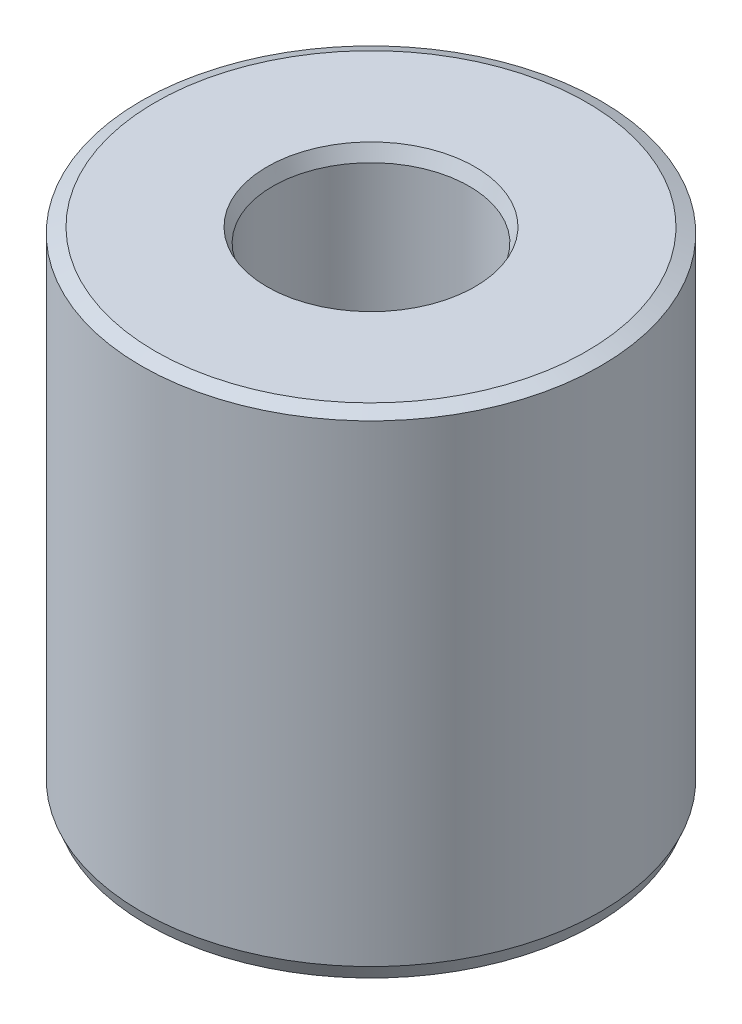
ISO-10303-21;
HEADER;
FILE_DESCRIPTION(('STEP AP214'),'2;1');
FILE_NAME('part.step','',(''),(''),'','','');
FILE_SCHEMA(('AUTOMOTIVE_DESIGN { 1 0 10303 214 1 1 1 1 }'));
ENDSEC;
DATA;
#1=APPLICATION_CONTEXT('core data for automotive mechanical design processes');
#2=APPLICATION_PROTOCOL_DEFINITION('international standard','automotive_design',2000,#1);
#3=PRODUCT_CONTEXT('',#1,'mechanical');
#4=PRODUCT('Part','Part','',(#3));
#5=PRODUCT_RELATED_PRODUCT_CATEGORY('part','',(#4));
#6=PRODUCT_DEFINITION_FORMATION('','',#4);
#7=PRODUCT_DEFINITION_CONTEXT('part definition',#1,'design');
#8=PRODUCT_DEFINITION('design','',#6,#7);
#9=PRODUCT_DEFINITION_SHAPE('','',#8);
#10=(LENGTH_UNIT() NAMED_UNIT(*) SI_UNIT(.MILLI.,.METRE.));
#11=(NAMED_UNIT(*) PLANE_ANGLE_UNIT() SI_UNIT($,.RADIAN.));
#12=(NAMED_UNIT(*) SI_UNIT($,.STERADIAN.) SOLID_ANGLE_UNIT());
#13=UNCERTAINTY_MEASURE_WITH_UNIT(LENGTH_MEASURE(1.E-05),#10,'distance_accuracy_value','');
#14=(GEOMETRIC_REPRESENTATION_CONTEXT(3) GLOBAL_UNCERTAINTY_ASSIGNED_CONTEXT((#13)) GLOBAL_UNIT_ASSIGNED_CONTEXT((#10,
#11,#12)) REPRESENTATION_CONTEXT('',''));
#15=CARTESIAN_POINT('',(0.,0.,0.));
#16=DIRECTION('',(0.,0.,1.));
#17=DIRECTION('',(1.,0.,0.));
#18=AXIS2_PLACEMENT_3D('',#15,#16,#17);
#19=CARTESIAN_POINT('',(0.,37.5116467703798,0.));
#20=DIRECTION('',(0.,-1.,0.));
#21=DIRECTION('',(0.,0.,-1.));
#22=AXIS2_PLACEMENT_3D('',#19,#20,#21);
#23=CYLINDRICAL_SURFACE('',#22,17.5);
#24=CARTESIAN_POINT('',(0.,1.06441298751191,0.));
#25=DIRECTION('',(0.,1.,0.));
#26=DIRECTION('',(0.,0.,1.));
#27=AXIS2_PLACEMENT_3D('',#24,#25,#26);
#28=CIRCLE('',#27,17.5);
#29=CARTESIAN_POINT('',(0.,1.06441298751191,17.5));
#30=VERTEX_POINT('',#29);
#31=EDGE_CURVE('E10',#30,#30,#28,.T.);
#32=ORIENTED_EDGE('',*,*,#31,.T.);
#33=EDGE_LOOP('',(#32));
#34=FACE_BOUND('',#33,.T.);
#35=CARTESIAN_POINT('',(0.,37.0762384011925,0.));
#36=DIRECTION('',(0.,1.,0.));
#37=DIRECTION('',(0.,0.,1.));
#38=AXIS2_PLACEMENT_3D('',#35,#36,#37);
#39=CIRCLE('',#38,17.5);
#40=CARTESIAN_POINT('',(0.,37.0762384011925,17.5));
#41=VERTEX_POINT('',#40);
#42=EDGE_CURVE('E50',#41,#41,#39,.F.);
#43=ORIENTED_EDGE('',*,*,#42,.T.);
#44=EDGE_LOOP('',(#43));
#45=FACE_BOUND('',#44,.T.);
#46=ADVANCED_FACE('F39',(#34,#45),#23,.T.);
#47=CARTESIAN_POINT('',(0.,37.5116467703798,0.));
#48=DIRECTION('',(0.,1.,0.));
#49=DIRECTION('',(0.,0.,1.));
#50=AXIS2_PLACEMENT_3D('',#47,#48,#49);
#51=PLANE('',#50);
#52=CARTESIAN_POINT('',(0.,37.5116467703798,0.));
#53=DIRECTION('',(0.,1.,0.));
#54=DIRECTION('',(0.,0.,1.));
#55=AXIS2_PLACEMENT_3D('',#52,#53,#54);
#56=CIRCLE('',#55,7.92191080034394);
#57=CARTESIAN_POINT('',(0.,37.5116467703798,7.92191080034394));
#58=VERTEX_POINT('',#57);
#59=EDGE_CURVE('E58',#58,#58,#56,.F.);
#60=ORIENTED_EDGE('',*,*,#59,.T.);
#61=EDGE_LOOP('',(#60));
#62=FACE_BOUND('',#61,.T.);
#63=CARTESIAN_POINT('',(0.,37.5116467703798,0.));
#64=DIRECTION('',(0.,1.,0.));
#65=DIRECTION('',(0.,0.,1.));
#66=AXIS2_PLACEMENT_3D('',#63,#64,#65);
#67=CIRCLE('',#66,16.435587012488);
#68=CARTESIAN_POINT('',(0.,37.5116467703798,16.435587012488));
#69=VERTEX_POINT('',#68);
#70=EDGE_CURVE('E61',#69,#69,#67,.T.);
#71=ORIENTED_EDGE('',*,*,#70,.T.);
#72=EDGE_LOOP('',(#71));
#73=FACE_BOUND('',#72,.T.);
#74=ADVANCED_FACE('F88',(#62,#73),#51,.T.);
#75=CARTESIAN_POINT('',(0.,0.,0.));
#76=DIRECTION('',(0.,1.,0.));
#77=DIRECTION('',(0.,0.,1.));
#78=AXIS2_PLACEMENT_3D('',#75,#76,#77);
#79=PLANE('',#78);
#80=CARTESIAN_POINT('',(0.,0.,0.));
#81=DIRECTION('',(0.,1.,0.));
#82=DIRECTION('',(0.,0.,1.));
#83=AXIS2_PLACEMENT_3D('',#80,#81,#82);
#84=CIRCLE('',#83,8.55091541866851);
#85=CARTESIAN_POINT('',(0.,0.,8.55091541866851));
#86=VERTEX_POINT('',#85);
#87=EDGE_CURVE('E51',#86,#86,#84,.T.);
#88=ORIENTED_EDGE('',*,*,#87,.T.);
#89=EDGE_LOOP('',(#88));
#90=FACE_BOUND('',#89,.T.);
#91=CARTESIAN_POINT('',(0.,0.,0.));
#92=DIRECTION('',(0.,1.,0.));
#93=DIRECTION('',(0.,0.,1.));
#94=AXIS2_PLACEMENT_3D('',#91,#92,#93);
#95=CIRCLE('',#94,17.0645916308126);
#96=CARTESIAN_POINT('',(0.,0.,17.0645916308126));
#97=VERTEX_POINT('',#96);
#98=EDGE_CURVE('E54',#97,#97,#95,.F.);
#99=ORIENTED_EDGE('',*,*,#98,.T.);
#100=EDGE_LOOP('',(#99));
#101=FACE_BOUND('',#100,.T.);
#102=ADVANCED_FACE('F83',(#90,#101),#79,.F.);
#103=CARTESIAN_POINT('',(0.,37.5116467703798,0.));
#104=DIRECTION('',(0.,-1.,0.));
#105=DIRECTION('',(0.,0.,-1.));
#106=AXIS2_PLACEMENT_3D('',#103,#104,#105);
#107=CYLINDRICAL_SURFACE('',#106,7.48650243115657);
#108=CARTESIAN_POINT('',(0.,36.4472337828679,0.));
#109=DIRECTION('',(0.,1.,0.));
#110=DIRECTION('',(0.,0.,1.));
#111=AXIS2_PLACEMENT_3D('',#108,#109,#110);
#112=CIRCLE('',#111,7.48650243115657);
#113=CARTESIAN_POINT('',(0.,36.4472337828679,7.48650243115657));
#114=VERTEX_POINT('',#113);
#115=EDGE_CURVE('E67',#114,#114,#112,.T.);
#116=ORIENTED_EDGE('',*,*,#115,.T.);
#117=EDGE_LOOP('',(#116));
#118=FACE_BOUND('',#117,.T.);
#119=CARTESIAN_POINT('',(0.,0.435408369187373,0.));
#120=DIRECTION('',(0.,1.,0.));
#121=DIRECTION('',(0.,0.,1.));
#122=AXIS2_PLACEMENT_3D('',#119,#120,#121);
#123=CIRCLE('',#122,7.48650243115657);
#124=CARTESIAN_POINT('',(0.,0.435408369187373,7.48650243115657));
#125=VERTEX_POINT('',#124);
#126=EDGE_CURVE('E69',#125,#125,#123,.F.);
#127=ORIENTED_EDGE('',*,*,#126,.T.);
#128=EDGE_LOOP('',(#127));
#129=FACE_BOUND('',#128,.T.);
#130=ADVANCED_FACE('F71',(#118,#129),#107,.F.);
#131=CARTESIAN_POINT('',(0.,36.4472337828679,0.));
#132=DIRECTION('',(0.,1.,0.));
#133=DIRECTION('',(0.,0.,1.));
#134=AXIS2_PLACEMENT_3D('',#131,#132,#133);
#135=CONICAL_SURFACE('',#134,7.48650243115657,0.388291912059998);
#136=ORIENTED_EDGE('',*,*,#59,.F.);
#137=EDGE_LOOP('',(#136));
#138=FACE_BOUND('',#137,.T.);
#139=ORIENTED_EDGE('',*,*,#115,.F.);
#140=EDGE_LOOP('',(#139));
#141=FACE_BOUND('',#140,.T.);
#142=ADVANCED_FACE('F77',(#138,#141),#135,.F.);
#143=CARTESIAN_POINT('',(0.,0.,0.));
#144=DIRECTION('',(0.,-1.,0.));
#145=DIRECTION('',(0.,0.,-1.));
#146=AXIS2_PLACEMENT_3D('',#143,#144,#145);
#147=CONICAL_SURFACE('',#146,8.55091541866851,1.1825044147349);
#148=ORIENTED_EDGE('',*,*,#126,.F.);
#149=EDGE_LOOP('',(#148));
#150=FACE_BOUND('',#149,.T.);
#151=ORIENTED_EDGE('',*,*,#87,.F.);
#152=EDGE_LOOP('',(#151));
#153=FACE_BOUND('',#152,.T.);
#154=ADVANCED_FACE('F73',(#150,#153),#147,.F.);
#155=CARTESIAN_POINT('',(0.,1.06441298751191,0.));
#156=DIRECTION('',(0.,1.,0.));
#157=DIRECTION('',(0.,0.,1.));
#158=AXIS2_PLACEMENT_3D('',#155,#156,#157);
#159=CONICAL_SURFACE('',#158,17.5,0.388291912059998);
#160=ORIENTED_EDGE('',*,*,#98,.F.);
#161=EDGE_LOOP('',(#160));
#162=FACE_BOUND('',#161,.T.);
#163=ORIENTED_EDGE('',*,*,#31,.F.);
#164=EDGE_LOOP('',(#163));
#165=FACE_BOUND('',#164,.T.);
#166=ADVANCED_FACE('F76',(#162,#165),#159,.T.);
#167=CARTESIAN_POINT('',(0.,37.5116467703798,0.));
#168=DIRECTION('',(0.,-1.,0.));
#169=DIRECTION('',(0.,0.,-1.));
#170=AXIS2_PLACEMENT_3D('',#167,#168,#169);
#171=CONICAL_SURFACE('',#170,16.435587012488,1.18250441473489);
#172=ORIENTED_EDGE('',*,*,#42,.F.);
#173=EDGE_LOOP('',(#172));
#174=FACE_BOUND('',#173,.T.);
#175=ORIENTED_EDGE('',*,*,#70,.F.);
#176=EDGE_LOOP('',(#175));
#177=FACE_BOUND('',#176,.T.);
#178=ADVANCED_FACE('F45',(#174,#177),#171,.T.);
#179=CLOSED_SHELL('',(#46,#74,#102,#130,#142,#154,#166,#178));
#180=MANIFOLD_SOLID_BREP('B2',#179);
#181=ADVANCED_BREP_SHAPE_REPRESENTATION('',(#18,#180),#14);
#182=SHAPE_DEFINITION_REPRESENTATION(#9,#181);
ENDSEC;
END-ISO-10303-21;
